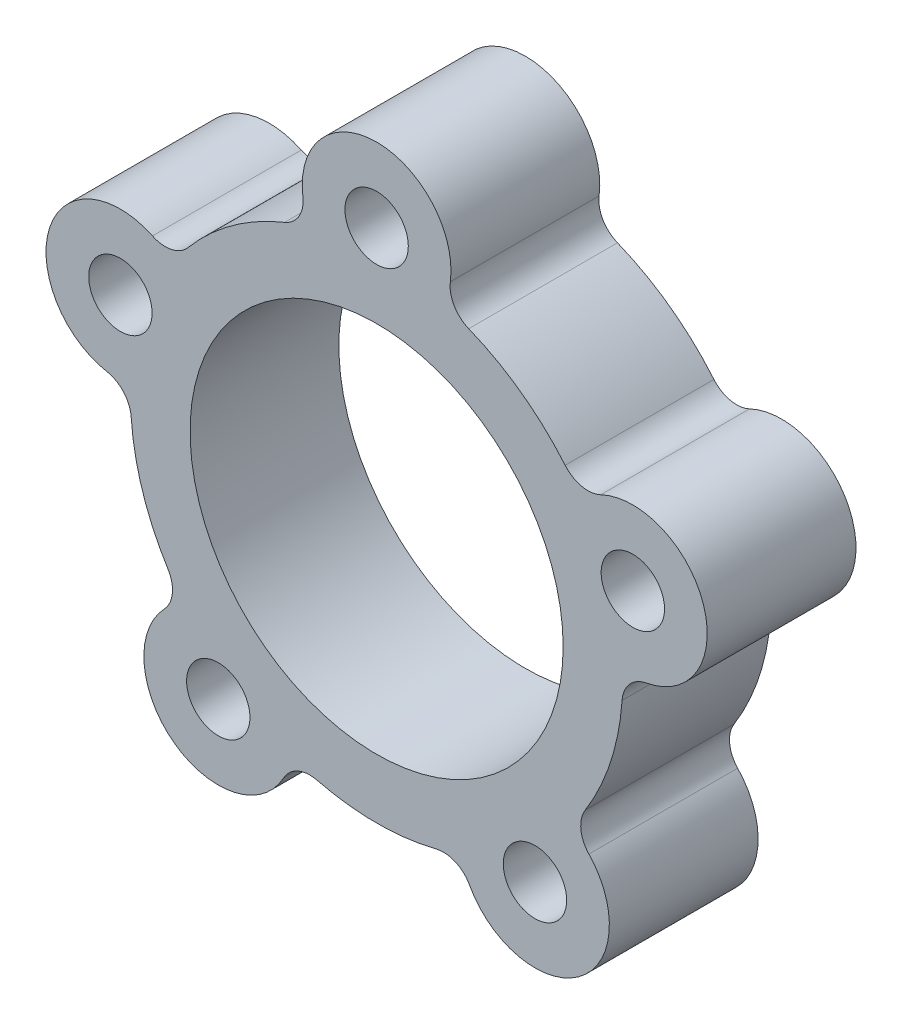
ISO-10303-21;
HEADER;
FILE_DESCRIPTION(('STEP AP214'),'2;1');
FILE_NAME('part.step','',(''),(''),'','','');
FILE_SCHEMA(('AUTOMOTIVE_DESIGN { 1 0 10303 214 1 1 1 1 }'));
ENDSEC;
DATA;
#1=APPLICATION_CONTEXT('core data for automotive mechanical design processes');
#2=APPLICATION_PROTOCOL_DEFINITION('international standard','automotive_design',2000,#1);
#3=PRODUCT_CONTEXT('',#1,'mechanical');
#4=PRODUCT('Part','Part','',(#3));
#5=PRODUCT_RELATED_PRODUCT_CATEGORY('part','',(#4));
#6=PRODUCT_DEFINITION_FORMATION('','',#4);
#7=PRODUCT_DEFINITION_CONTEXT('part definition',#1,'design');
#8=PRODUCT_DEFINITION('design','',#6,#7);
#9=PRODUCT_DEFINITION_SHAPE('','',#8);
#10=(LENGTH_UNIT() NAMED_UNIT(*) SI_UNIT(.MILLI.,.METRE.));
#11=(NAMED_UNIT(*) PLANE_ANGLE_UNIT() SI_UNIT($,.RADIAN.));
#12=(NAMED_UNIT(*) SI_UNIT($,.STERADIAN.) SOLID_ANGLE_UNIT());
#13=UNCERTAINTY_MEASURE_WITH_UNIT(LENGTH_MEASURE(1.E-05),#10,'distance_accuracy_value','');
#14=(GEOMETRIC_REPRESENTATION_CONTEXT(3) GLOBAL_UNCERTAINTY_ASSIGNED_CONTEXT((#13)) GLOBAL_UNIT_ASSIGNED_CONTEXT((#10,
#11,#12)) REPRESENTATION_CONTEXT('',''));
#15=CARTESIAN_POINT('',(0.,0.,0.));
#16=DIRECTION('',(0.,0.,1.));
#17=DIRECTION('',(1.,0.,0.));
#18=AXIS2_PLACEMENT_3D('',#15,#16,#17);
#19=CARTESIAN_POINT('',(2.20330688721595,5.45854672630424,14.224));
#20=DIRECTION('',(0.,0.,1.));
#21=DIRECTION('',(1.,0.,0.));
#22=AXIS2_PLACEMENT_3D('',#19,#20,#21);
#23=PLANE('',#22);
#24=CARTESIAN_POINT('',(-10.9371499373943,3.55369543530763,14.224));
#25=DIRECTION('',(0.,0.,1.));
#26=DIRECTION('',(1.,0.,0.));
#27=AXIS2_PLACEMENT_3D('',#24,#25,#26);
#28=CIRCLE('',#27,1.35255);
#29=CARTESIAN_POINT('',(-9.58459993739428,3.55369543530763,14.224));
#30=VERTEX_POINT('',#29);
#31=EDGE_CURVE('E409',#30,#30,#28,.T.);
#32=ORIENTED_EDGE('',*,*,#31,.F.);
#33=EDGE_LOOP('',(#32));
#34=FACE_BOUND('',#33,.T.);
#35=CARTESIAN_POINT('',(0.,11.4999999999958,14.224));
#36=DIRECTION('',(0.,0.,1.));
#37=DIRECTION('',(1.,0.,0.));
#38=AXIS2_PLACEMENT_3D('',#35,#36,#37);
#39=CIRCLE('',#38,1.35255);
#40=CARTESIAN_POINT('',(1.35255,11.4999999999958,14.224));
#41=VERTEX_POINT('',#40);
#42=EDGE_CURVE('E411',#41,#41,#39,.T.);
#43=ORIENTED_EDGE('',*,*,#42,.F.);
#44=EDGE_LOOP('',(#43));
#45=FACE_BOUND('',#44,.T.);
#46=CARTESIAN_POINT('',(10.9371499373942,3.55369543530779,14.224));
#47=DIRECTION('',(0.,0.,1.));
#48=DIRECTION('',(1.,0.,0.));
#49=AXIS2_PLACEMENT_3D('',#46,#47,#48);
#50=CIRCLE('',#49,1.35255);
#51=CARTESIAN_POINT('',(12.2896999373942,3.55369543530779,14.224));
#52=VERTEX_POINT('',#51);
#53=EDGE_CURVE('E419',#52,#52,#50,.T.);
#54=ORIENTED_EDGE('',*,*,#53,.F.);
#55=EDGE_LOOP('',(#54));
#56=FACE_BOUND('',#55,.T.);
#57=CARTESIAN_POINT('',(6.75953040136352,-9.30369543531607,14.224));
#58=DIRECTION('',(0.,0.,1.));
#59=DIRECTION('',(1.,0.,0.));
#60=AXIS2_PLACEMENT_3D('',#57,#58,#59);
#61=CIRCLE('',#60,1.35255);
#62=CARTESIAN_POINT('',(8.11208040136352,-9.30369543531607,14.224));
#63=VERTEX_POINT('',#62);
#64=EDGE_CURVE('E425',#63,#63,#61,.T.);
#65=ORIENTED_EDGE('',*,*,#64,.F.);
#66=EDGE_LOOP('',(#65));
#67=FACE_BOUND('',#66,.T.);
#68=CARTESIAN_POINT('',(-6.75953040136339,-9.30369543531617,14.224));
#69=DIRECTION('',(0.,0.,1.));
#70=DIRECTION('',(1.,0.,0.));
#71=AXIS2_PLACEMENT_3D('',#68,#69,#70);
#72=CIRCLE('',#71,1.35255);
#73=CARTESIAN_POINT('',(-5.40698040136339,-9.30369543531617,14.224));
#74=VERTEX_POINT('',#73);
#75=EDGE_CURVE('E431',#74,#74,#72,.T.);
#76=ORIENTED_EDGE('',*,*,#75,.F.);
#77=EDGE_LOOP('',(#76));
#78=FACE_BOUND('',#77,.T.);
#79=CARTESIAN_POINT('',(4.40661377443191,10.9170934526085,14.224));
#80=DIRECTION('',(0.,0.,-1.));
#81=DIRECTION('',(1.,0.,0.));
#82=AXIS2_PLACEMENT_3D('',#79,#80,#81);
#83=CIRCLE('',#82,1.27);
#84=CARTESIAN_POINT('',(3.93125090771865,9.73941346850832,14.224));
#85=VERTEX_POINT('',#84);
#86=CARTESIAN_POINT('',(3.14758126745136,11.0836381804334,14.224));
#87=VERTEX_POINT('',#86);
#88=EDGE_CURVE('E253',#85,#87,#83,.T.);
#89=ORIENTED_EDGE('',*,*,#88,.T.);
#90=CARTESIAN_POINT('',(0.,11.4999999999958,14.224));
#91=DIRECTION('',(0.,0.,1.));
#92=DIRECTION('',(1.,0.,0.));
#93=AXIS2_PLACEMENT_3D('',#90,#91,#92);
#94=CIRCLE('',#93,3.175);
#95=CARTESIAN_POINT('',(-3.14758126745136,11.0836381804334,14.224));
#96=VERTEX_POINT('',#95);
#97=EDGE_CURVE('E141',#87,#96,#94,.T.);
#98=ORIENTED_EDGE('',*,*,#97,.T.);
#99=CARTESIAN_POINT('',(-4.40661377443191,10.9170934526085,14.224));
#100=DIRECTION('',(0.,0.,-1.));
#101=DIRECTION('',(1.,0.,0.));
#102=AXIS2_PLACEMENT_3D('',#99,#100,#101);
#103=CIRCLE('',#102,1.27);
#104=CARTESIAN_POINT('',(-3.93125090771865,9.73941346850832,14.224));
#105=VERTEX_POINT('',#104);
#106=EDGE_CURVE('E304',#96,#105,#103,.T.);
#107=ORIENTED_EDGE('',*,*,#106,.T.);
#108=CARTESIAN_POINT('',(0.,0.,14.224));
#109=DIRECTION('',(0.,0.,1.));
#110=DIRECTION('',(1.,0.,0.));
#111=AXIS2_PLACEMENT_3D('',#108,#109,#110);
#112=CIRCLE('',#111,10.5029);
#113=CARTESIAN_POINT('',(-8.04790930448323,6.74848606998727,14.224));
#114=VERTEX_POINT('',#113);
#115=EDGE_CURVE('E323',#105,#114,#112,.T.);
#116=ORIENTED_EDGE('',*,*,#115,.T.);
#117=CARTESIAN_POINT('',(-9.02105432316319,7.56450615100145,14.224));
#118=DIRECTION('',(0.,0.,-1.));
#119=DIRECTION('',(1.,0.,0.));
#120=AXIS2_PLACEMENT_3D('',#117,#118,#119);
#121=CIRCLE('',#120,1.27);
#122=CARTESIAN_POINT('',(-9.5685102129435,6.41856023223179,14.224));
#123=VERTEX_POINT('',#122);
#124=EDGE_CURVE('E320',#114,#123,#121,.T.);
#125=ORIENTED_EDGE('',*,*,#124,.T.);
#126=CARTESIAN_POINT('',(-10.9371499373943,3.55369543530763,14.224));
#127=DIRECTION('',(0.,0.,1.));
#128=DIRECTION('',(1.,0.,0.));
#129=AXIS2_PLACEMENT_3D('',#126,#127,#128);
#130=CIRCLE('',#129,3.175);
#131=CARTESIAN_POINT('',(-11.5138224185786,0.431504882275248,14.224));
#132=VERTEX_POINT('',#131);
#133=EDGE_CURVE('E322',#123,#132,#130,.T.);
#134=ORIENTED_EDGE('',*,*,#133,.T.);
#135=CARTESIAN_POINT('',(-11.7444914110524,-0.817371338937707,14.224));
#136=DIRECTION('',(0.,0.,-1.));
#137=DIRECTION('',(1.,0.,0.));
#138=AXIS2_PLACEMENT_3D('',#135,#136,#137);
#139=CIRCLE('',#138,1.27);
#140=CARTESIAN_POINT('',(-10.4775559837544,-0.729197515967081,14.224));
#141=VERTEX_POINT('',#140);
#142=EDGE_CURVE('E325',#132,#141,#139,.T.);
#143=ORIENTED_EDGE('',*,*,#142,.T.);
#144=CARTESIAN_POINT('',(0.,0.,14.224));
#145=DIRECTION('',(0.,0.,1.));
#146=DIRECTION('',(1.,0.,0.));
#147=AXIS2_PLACEMENT_3D('',#144,#145,#146);
#148=CIRCLE('',#147,10.5029);
#149=CARTESIAN_POINT('',(-8.90513239626248,-5.56861970465182,14.224));
#150=VERTEX_POINT('',#149);
#151=EDGE_CURVE('E331',#141,#150,#148,.T.);
#152=ORIENTED_EDGE('',*,*,#151,.T.);
#153=CARTESIAN_POINT('',(-9.98193196050219,-6.24197154318288,14.224));
#154=DIRECTION('',(0.,0.,-1.));
#155=DIRECTION('',(1.,0.,0.));
#156=AXIS2_PLACEMENT_3D('',#153,#154,#155);
#157=CIRCLE('',#156,1.27);
#158=CARTESIAN_POINT('',(-9.06124580074825,-7.11674979807811,14.224));
#159=VERTEX_POINT('',#158);
#160=EDGE_CURVE('E333',#150,#159,#157,.T.);
#161=ORIENTED_EDGE('',*,*,#160,.T.);
#162=CARTESIAN_POINT('',(-6.75953040136339,-9.30369543531617,14.224));
#163=DIRECTION('',(0.,0.,1.));
#164=DIRECTION('',(1.,0.,0.));
#165=AXIS2_PLACEMENT_3D('',#162,#163,#164);
#166=CIRCLE('',#165,3.175);
#167=CARTESIAN_POINT('',(-3.96835232765976,-10.8169534968761,14.224));
#168=VERTEX_POINT('',#167);
#169=EDGE_CURVE('E335',#159,#168,#166,.T.);
#170=ORIENTED_EDGE('',*,*,#169,.T.);
#171=CARTESIAN_POINT('',(-2.85188109817831,-11.4222567215001,14.224));
#172=DIRECTION('',(0.,0.,-1.));
#173=DIRECTION('',(1.,0.,0.));
#174=AXIS2_PLACEMENT_3D('',#171,#172,#173);
#175=CIRCLE('',#174,1.27);
#176=CARTESIAN_POINT('',(-2.54423480927019,-10.1900823178862,14.224));
#177=VERTEX_POINT('',#176);
#178=EDGE_CURVE('E337',#168,#177,#175,.T.);
#179=ORIENTED_EDGE('',*,*,#178,.T.);
#180=CARTESIAN_POINT('',(0.,0.,14.224));
#181=DIRECTION('',(0.,0.,1.));
#182=DIRECTION('',(1.,0.,0.));
#183=AXIS2_PLACEMENT_3D('',#180,#181,#182);
#184=CIRCLE('',#183,10.5029);
#185=CARTESIAN_POINT('',(2.54423480927033,-10.1900823178862,14.224));
#186=VERTEX_POINT('',#185);
#187=EDGE_CURVE('E339',#177,#186,#184,.T.);
#188=ORIENTED_EDGE('',*,*,#187,.T.);
#189=CARTESIAN_POINT('',(2.85188109817848,-11.4222567215,14.224));
#190=DIRECTION('',(0.,0.,-1.));
#191=DIRECTION('',(1.,0.,0.));
#192=AXIS2_PLACEMENT_3D('',#189,#190,#191);
#193=CIRCLE('',#192,1.27);
#194=CARTESIAN_POINT('',(3.96835232765992,-10.816953496876,14.224));
#195=VERTEX_POINT('',#194);
#196=EDGE_CURVE('E341',#186,#195,#193,.T.);
#197=ORIENTED_EDGE('',*,*,#196,.T.);
#198=CARTESIAN_POINT('',(6.75953040136352,-9.30369543531607,14.224));
#199=DIRECTION('',(0.,0.,1.));
#200=DIRECTION('',(1.,0.,0.));
#201=AXIS2_PLACEMENT_3D('',#198,#199,#200);
#202=CIRCLE('',#201,3.175);
#203=CARTESIAN_POINT('',(9.06124580074835,-7.11674979807798,14.224));
#204=VERTEX_POINT('',#203);
#205=EDGE_CURVE('E343',#195,#204,#202,.T.);
#206=ORIENTED_EDGE('',*,*,#205,.T.);
#207=CARTESIAN_POINT('',(9.98193196050228,-6.24197154318274,14.224));
#208=DIRECTION('',(0.,0.,-1.));
#209=DIRECTION('',(1.,0.,0.));
#210=AXIS2_PLACEMENT_3D('',#207,#208,#209);
#211=CIRCLE('',#210,1.27);
#212=CARTESIAN_POINT('',(8.90513239626255,-5.5686197046517,14.224));
#213=VERTEX_POINT('',#212);
#214=EDGE_CURVE('E345',#204,#213,#211,.T.);
#215=ORIENTED_EDGE('',*,*,#214,.T.);
#216=CARTESIAN_POINT('',(0.,0.,14.224));
#217=DIRECTION('',(0.,0.,1.));
#218=DIRECTION('',(1.,0.,0.));
#219=AXIS2_PLACEMENT_3D('',#216,#217,#218);
#220=CIRCLE('',#219,10.5029);
#221=CARTESIAN_POINT('',(10.4775559837544,-0.729197515966938,14.224));
#222=VERTEX_POINT('',#221);
#223=EDGE_CURVE('E347',#213,#222,#220,.T.);
#224=ORIENTED_EDGE('',*,*,#223,.T.);
#225=CARTESIAN_POINT('',(11.7444914110524,-0.817371338937544,14.224));
#226=DIRECTION('',(0.,0.,-1.));
#227=DIRECTION('',(1.,0.,0.));
#228=AXIS2_PLACEMENT_3D('',#225,#226,#227);
#229=CIRCLE('',#228,1.27);
#230=CARTESIAN_POINT('',(11.5138224185786,0.431504882275408,14.224));
#231=VERTEX_POINT('',#230);
#232=EDGE_CURVE('E196',#222,#231,#229,.T.);
#233=ORIENTED_EDGE('',*,*,#232,.T.);
#234=CARTESIAN_POINT('',(10.9371499373942,3.55369543530779,14.224));
#235=DIRECTION('',(0.,0.,1.));
#236=DIRECTION('',(1.,0.,0.));
#237=AXIS2_PLACEMENT_3D('',#234,#235,#236);
#238=CIRCLE('',#237,3.175);
#239=CARTESIAN_POINT('',(9.5685102129434,6.41856023223192,14.224));
#240=VERTEX_POINT('',#239);
#241=EDGE_CURVE('E190',#231,#240,#238,.T.);
#242=ORIENTED_EDGE('',*,*,#241,.T.);
#243=CARTESIAN_POINT('',(9.02105432316308,7.56450615100158,14.224));
#244=DIRECTION('',(0.,0.,-1.));
#245=DIRECTION('',(1.,0.,0.));
#246=AXIS2_PLACEMENT_3D('',#243,#244,#245);
#247=CIRCLE('',#246,1.27);
#248=CARTESIAN_POINT('',(8.04790930448314,6.74848606998738,14.224));
#249=VERTEX_POINT('',#248);
#250=EDGE_CURVE('E194',#240,#249,#247,.T.);
#251=ORIENTED_EDGE('',*,*,#250,.T.);
#252=CARTESIAN_POINT('',(0.,0.,14.224));
#253=DIRECTION('',(0.,0.,1.));
#254=DIRECTION('',(1.,0.,0.));
#255=AXIS2_PLACEMENT_3D('',#252,#253,#254);
#256=CIRCLE('',#255,10.5029);
#257=EDGE_CURVE('E62',#249,#85,#256,.T.);
#258=ORIENTED_EDGE('',*,*,#257,.T.);
#259=EDGE_LOOP('',(#89,#98,#107,#116,#125,#134,#143,#152,#161,#170,#179,#188,#197,#206,#215,
#224,#233,#242,#251,#258));
#260=FACE_BOUND('',#259,.T.);
#261=CARTESIAN_POINT('',(0.,0.,14.224));
#262=DIRECTION('',(0.,0.,1.));
#263=DIRECTION('',(1.,0.,0.));
#264=AXIS2_PLACEMENT_3D('',#261,#262,#263);
#265=CIRCLE('',#264,7.9629);
#266=CARTESIAN_POINT('',(7.9629,0.,14.224));
#267=VERTEX_POINT('',#266);
#268=EDGE_CURVE('E218',#267,#267,#265,.T.);
#269=ORIENTED_EDGE('',*,*,#268,.F.);
#270=EDGE_LOOP('',(#269));
#271=FACE_BOUND('',#270,.T.);
#272=ADVANCED_FACE('F45',(#34,#45,#56,#67,#78,#260,#271),#23,.T.);
#273=CARTESIAN_POINT('',(2.20330688721595,5.45854672630424,7.874));
#274=DIRECTION('',(0.,0.,1.));
#275=DIRECTION('',(1.,0.,0.));
#276=AXIS2_PLACEMENT_3D('',#273,#274,#275);
#277=PLANE('',#276);
#278=CARTESIAN_POINT('',(-10.9371499373943,3.55369543530763,7.874));
#279=DIRECTION('',(0.,0.,1.));
#280=DIRECTION('',(1.,0.,0.));
#281=AXIS2_PLACEMENT_3D('',#278,#279,#280);
#282=CIRCLE('',#281,1.35255);
#283=CARTESIAN_POINT('',(-9.58459993739428,3.55369543530763,7.874));
#284=VERTEX_POINT('',#283);
#285=EDGE_CURVE('E407',#284,#284,#282,.T.);
#286=ORIENTED_EDGE('',*,*,#285,.T.);
#287=EDGE_LOOP('',(#286));
#288=FACE_BOUND('',#287,.T.);
#289=CARTESIAN_POINT('',(0.,11.4999999999958,7.874));
#290=DIRECTION('',(0.,0.,1.));
#291=DIRECTION('',(1.,0.,0.));
#292=AXIS2_PLACEMENT_3D('',#289,#290,#291);
#293=CIRCLE('',#292,1.35255);
#294=CARTESIAN_POINT('',(1.35255,11.4999999999958,7.874));
#295=VERTEX_POINT('',#294);
#296=EDGE_CURVE('E416',#295,#295,#293,.T.);
#297=ORIENTED_EDGE('',*,*,#296,.T.);
#298=EDGE_LOOP('',(#297));
#299=FACE_BOUND('',#298,.T.);
#300=CARTESIAN_POINT('',(10.9371499373942,3.55369543530779,7.874));
#301=DIRECTION('',(0.,0.,1.));
#302=DIRECTION('',(1.,0.,0.));
#303=AXIS2_PLACEMENT_3D('',#300,#301,#302);
#304=CIRCLE('',#303,1.35255);
#305=CARTESIAN_POINT('',(12.2896999373942,3.55369543530779,7.874));
#306=VERTEX_POINT('',#305);
#307=EDGE_CURVE('E422',#306,#306,#304,.T.);
#308=ORIENTED_EDGE('',*,*,#307,.T.);
#309=EDGE_LOOP('',(#308));
#310=FACE_BOUND('',#309,.T.);
#311=CARTESIAN_POINT('',(6.75953040136352,-9.30369543531607,7.874));
#312=DIRECTION('',(0.,0.,1.));
#313=DIRECTION('',(1.,0.,0.));
#314=AXIS2_PLACEMENT_3D('',#311,#312,#313);
#315=CIRCLE('',#314,1.35255);
#316=CARTESIAN_POINT('',(8.11208040136352,-9.30369543531607,7.874));
#317=VERTEX_POINT('',#316);
#318=EDGE_CURVE('E428',#317,#317,#315,.T.);
#319=ORIENTED_EDGE('',*,*,#318,.T.);
#320=EDGE_LOOP('',(#319));
#321=FACE_BOUND('',#320,.T.);
#322=CARTESIAN_POINT('',(-6.75953040136339,-9.30369543531617,7.874));
#323=DIRECTION('',(0.,0.,1.));
#324=DIRECTION('',(1.,0.,0.));
#325=AXIS2_PLACEMENT_3D('',#322,#323,#324);
#326=CIRCLE('',#325,1.35255);
#327=CARTESIAN_POINT('',(-5.40698040136339,-9.30369543531617,7.874));
#328=VERTEX_POINT('',#327);
#329=EDGE_CURVE('E434',#328,#328,#326,.T.);
#330=ORIENTED_EDGE('',*,*,#329,.T.);
#331=EDGE_LOOP('',(#330));
#332=FACE_BOUND('',#331,.T.);
#333=CARTESIAN_POINT('',(4.40661377443191,10.9170934526085,7.874));
#334=DIRECTION('',(0.,0.,-1.));
#335=DIRECTION('',(1.,0.,0.));
#336=AXIS2_PLACEMENT_3D('',#333,#334,#335);
#337=CIRCLE('',#336,1.27);
#338=CARTESIAN_POINT('',(3.93125090771865,9.73941346850832,7.874));
#339=VERTEX_POINT('',#338);
#340=CARTESIAN_POINT('',(3.14758126745136,11.0836381804334,7.874));
#341=VERTEX_POINT('',#340);
#342=EDGE_CURVE('E214',#339,#341,#337,.T.);
#343=ORIENTED_EDGE('',*,*,#342,.F.);
#344=CARTESIAN_POINT('',(0.,0.,7.874));
#345=DIRECTION('',(0.,0.,1.));
#346=DIRECTION('',(1.,0.,0.));
#347=AXIS2_PLACEMENT_3D('',#344,#345,#346);
#348=CIRCLE('',#347,10.5029);
#349=CARTESIAN_POINT('',(8.04790930448314,6.74848606998738,7.874));
#350=VERTEX_POINT('',#349);
#351=EDGE_CURVE('E133',#350,#339,#348,.T.);
#352=ORIENTED_EDGE('',*,*,#351,.F.);
#353=CARTESIAN_POINT('',(9.02105432316308,7.56450615100158,7.874));
#354=DIRECTION('',(0.,0.,-1.));
#355=DIRECTION('',(1.,0.,0.));
#356=AXIS2_PLACEMENT_3D('',#353,#354,#355);
#357=CIRCLE('',#356,1.27);
#358=CARTESIAN_POINT('',(9.5685102129434,6.41856023223192,7.874));
#359=VERTEX_POINT('',#358);
#360=EDGE_CURVE('E127',#359,#350,#357,.T.);
#361=ORIENTED_EDGE('',*,*,#360,.F.);
#362=CARTESIAN_POINT('',(10.9371499373942,3.55369543530779,7.874));
#363=DIRECTION('',(0.,0.,1.));
#364=DIRECTION('',(1.,0.,0.));
#365=AXIS2_PLACEMENT_3D('',#362,#363,#364);
#366=CIRCLE('',#365,3.175);
#367=CARTESIAN_POINT('',(11.5138224185786,0.431504882275408,7.874));
#368=VERTEX_POINT('',#367);
#369=EDGE_CURVE('E204',#368,#359,#366,.T.);
#370=ORIENTED_EDGE('',*,*,#369,.F.);
#371=CARTESIAN_POINT('',(11.7444914110524,-0.817371338937544,7.874));
#372=DIRECTION('',(0.,0.,-1.));
#373=DIRECTION('',(1.,0.,0.));
#374=AXIS2_PLACEMENT_3D('',#371,#372,#373);
#375=CIRCLE('',#374,1.27);
#376=CARTESIAN_POINT('',(10.4775559837544,-0.729197515966938,7.874));
#377=VERTEX_POINT('',#376);
#378=EDGE_CURVE('E248',#377,#368,#375,.T.);
#379=ORIENTED_EDGE('',*,*,#378,.F.);
#380=CARTESIAN_POINT('',(0.,0.,7.874));
#381=DIRECTION('',(0.,0.,1.));
#382=DIRECTION('',(1.,0.,0.));
#383=AXIS2_PLACEMENT_3D('',#380,#381,#382);
#384=CIRCLE('',#383,10.5029);
#385=CARTESIAN_POINT('',(8.90513239626255,-5.5686197046517,7.874));
#386=VERTEX_POINT('',#385);
#387=EDGE_CURVE('E246',#386,#377,#384,.T.);
#388=ORIENTED_EDGE('',*,*,#387,.F.);
#389=CARTESIAN_POINT('',(9.98193196050228,-6.24197154318274,7.874));
#390=DIRECTION('',(0.,0.,-1.));
#391=DIRECTION('',(1.,0.,0.));
#392=AXIS2_PLACEMENT_3D('',#389,#390,#391);
#393=CIRCLE('',#392,1.27);
#394=CARTESIAN_POINT('',(9.06124580074835,-7.11674979807798,7.874));
#395=VERTEX_POINT('',#394);
#396=EDGE_CURVE('E244',#395,#386,#393,.T.);
#397=ORIENTED_EDGE('',*,*,#396,.F.);
#398=CARTESIAN_POINT('',(6.75953040136352,-9.30369543531607,7.874));
#399=DIRECTION('',(0.,0.,1.));
#400=DIRECTION('',(1.,0.,0.));
#401=AXIS2_PLACEMENT_3D('',#398,#399,#400);
#402=CIRCLE('',#401,3.175);
#403=CARTESIAN_POINT('',(3.96835232765992,-10.816953496876,7.874));
#404=VERTEX_POINT('',#403);
#405=EDGE_CURVE('E242',#404,#395,#402,.T.);
#406=ORIENTED_EDGE('',*,*,#405,.F.);
#407=CARTESIAN_POINT('',(2.85188109817848,-11.4222567215,7.874));
#408=DIRECTION('',(0.,0.,-1.));
#409=DIRECTION('',(1.,0.,0.));
#410=AXIS2_PLACEMENT_3D('',#407,#408,#409);
#411=CIRCLE('',#410,1.27);
#412=CARTESIAN_POINT('',(2.54423480927033,-10.1900823178862,7.874));
#413=VERTEX_POINT('',#412);
#414=EDGE_CURVE('E240',#413,#404,#411,.T.);
#415=ORIENTED_EDGE('',*,*,#414,.F.);
#416=CARTESIAN_POINT('',(0.,0.,7.874));
#417=DIRECTION('',(0.,0.,1.));
#418=DIRECTION('',(1.,0.,0.));
#419=AXIS2_PLACEMENT_3D('',#416,#417,#418);
#420=CIRCLE('',#419,10.5029);
#421=CARTESIAN_POINT('',(-2.54423480927019,-10.1900823178862,7.874));
#422=VERTEX_POINT('',#421);
#423=EDGE_CURVE('E238',#422,#413,#420,.T.);
#424=ORIENTED_EDGE('',*,*,#423,.F.);
#425=CARTESIAN_POINT('',(-2.85188109817831,-11.4222567215001,7.874));
#426=DIRECTION('',(0.,0.,-1.));
#427=DIRECTION('',(1.,0.,0.));
#428=AXIS2_PLACEMENT_3D('',#425,#426,#427);
#429=CIRCLE('',#428,1.27);
#430=CARTESIAN_POINT('',(-3.96835232765976,-10.8169534968761,7.874));
#431=VERTEX_POINT('',#430);
#432=EDGE_CURVE('E236',#431,#422,#429,.T.);
#433=ORIENTED_EDGE('',*,*,#432,.F.);
#434=CARTESIAN_POINT('',(-6.75953040136339,-9.30369543531617,7.874));
#435=DIRECTION('',(0.,0.,1.));
#436=DIRECTION('',(1.,0.,0.));
#437=AXIS2_PLACEMENT_3D('',#434,#435,#436);
#438=CIRCLE('',#437,3.175);
#439=CARTESIAN_POINT('',(-9.06124580074825,-7.11674979807811,7.874));
#440=VERTEX_POINT('',#439);
#441=EDGE_CURVE('E234',#440,#431,#438,.T.);
#442=ORIENTED_EDGE('',*,*,#441,.F.);
#443=CARTESIAN_POINT('',(-9.98193196050219,-6.24197154318288,7.874));
#444=DIRECTION('',(0.,0.,-1.));
#445=DIRECTION('',(1.,0.,0.));
#446=AXIS2_PLACEMENT_3D('',#443,#444,#445);
#447=CIRCLE('',#446,1.27);
#448=CARTESIAN_POINT('',(-8.90513239626248,-5.56861970465182,7.874));
#449=VERTEX_POINT('',#448);
#450=EDGE_CURVE('E232',#449,#440,#447,.T.);
#451=ORIENTED_EDGE('',*,*,#450,.F.);
#452=CARTESIAN_POINT('',(0.,0.,7.874));
#453=DIRECTION('',(0.,0.,1.));
#454=DIRECTION('',(1.,0.,0.));
#455=AXIS2_PLACEMENT_3D('',#452,#453,#454);
#456=CIRCLE('',#455,10.5029);
#457=CARTESIAN_POINT('',(-10.4775559837544,-0.729197515967081,7.874));
#458=VERTEX_POINT('',#457);
#459=EDGE_CURVE('E230',#458,#449,#456,.T.);
#460=ORIENTED_EDGE('',*,*,#459,.F.);
#461=CARTESIAN_POINT('',(-11.7444914110524,-0.817371338937707,7.874));
#462=DIRECTION('',(0.,0.,-1.));
#463=DIRECTION('',(1.,0.,0.));
#464=AXIS2_PLACEMENT_3D('',#461,#462,#463);
#465=CIRCLE('',#464,1.27);
#466=CARTESIAN_POINT('',(-11.5138224185786,0.431504882275248,7.874));
#467=VERTEX_POINT('',#466);
#468=EDGE_CURVE('E228',#467,#458,#465,.T.);
#469=ORIENTED_EDGE('',*,*,#468,.F.);
#470=CARTESIAN_POINT('',(-10.9371499373943,3.55369543530763,7.874));
#471=DIRECTION('',(0.,0.,1.));
#472=DIRECTION('',(1.,0.,0.));
#473=AXIS2_PLACEMENT_3D('',#470,#471,#472);
#474=CIRCLE('',#473,3.175);
#475=CARTESIAN_POINT('',(-9.5685102129435,6.41856023223179,7.874));
#476=VERTEX_POINT('',#475);
#477=EDGE_CURVE('E226',#476,#467,#474,.T.);
#478=ORIENTED_EDGE('',*,*,#477,.F.);
#479=CARTESIAN_POINT('',(-9.02105432316319,7.56450615100145,7.874));
#480=DIRECTION('',(0.,0.,-1.));
#481=DIRECTION('',(1.,0.,0.));
#482=AXIS2_PLACEMENT_3D('',#479,#480,#481);
#483=CIRCLE('',#482,1.27);
#484=CARTESIAN_POINT('',(-8.04790930448323,6.74848606998727,7.874));
#485=VERTEX_POINT('',#484);
#486=EDGE_CURVE('E224',#485,#476,#483,.T.);
#487=ORIENTED_EDGE('',*,*,#486,.F.);
#488=CARTESIAN_POINT('',(0.,0.,7.874));
#489=DIRECTION('',(0.,0.,1.));
#490=DIRECTION('',(1.,0.,0.));
#491=AXIS2_PLACEMENT_3D('',#488,#489,#490);
#492=CIRCLE('',#491,10.5029);
#493=CARTESIAN_POINT('',(-3.93125090771865,9.73941346850832,7.874));
#494=VERTEX_POINT('',#493);
#495=EDGE_CURVE('E222',#494,#485,#492,.T.);
#496=ORIENTED_EDGE('',*,*,#495,.F.);
#497=CARTESIAN_POINT('',(-4.40661377443191,10.9170934526085,7.874));
#498=DIRECTION('',(0.,0.,-1.));
#499=DIRECTION('',(1.,0.,0.));
#500=AXIS2_PLACEMENT_3D('',#497,#498,#499);
#501=CIRCLE('',#500,1.27);
#502=CARTESIAN_POINT('',(-3.14758126745136,11.0836381804334,7.874));
#503=VERTEX_POINT('',#502);
#504=EDGE_CURVE('E220',#503,#494,#501,.T.);
#505=ORIENTED_EDGE('',*,*,#504,.F.);
#506=CARTESIAN_POINT('',(0.,11.4999999999958,7.874));
#507=DIRECTION('',(0.,0.,1.));
#508=DIRECTION('',(1.,0.,0.));
#509=AXIS2_PLACEMENT_3D('',#506,#507,#508);
#510=CIRCLE('',#509,3.175);
#511=EDGE_CURVE('E217',#341,#503,#510,.T.);
#512=ORIENTED_EDGE('',*,*,#511,.F.);
#513=EDGE_LOOP('',(#343,#352,#361,#370,#379,#388,#397,#406,#415,#424,#433,#442,#451,#460,#469,
#478,#487,#496,#505,#512));
#514=FACE_BOUND('',#513,.T.);
#515=CARTESIAN_POINT('',(0.,0.,7.874));
#516=DIRECTION('',(0.,0.,1.));
#517=DIRECTION('',(1.,0.,0.));
#518=AXIS2_PLACEMENT_3D('',#515,#516,#517);
#519=CIRCLE('',#518,7.9629);
#520=CARTESIAN_POINT('',(7.9629,0.,7.874));
#521=VERTEX_POINT('',#520);
#522=EDGE_CURVE('E437',#521,#521,#519,.T.);
#523=ORIENTED_EDGE('',*,*,#522,.T.);
#524=EDGE_LOOP('',(#523));
#525=FACE_BOUND('',#524,.T.);
#526=ADVANCED_FACE('F308',(#288,#299,#310,#321,#332,#514,#525),#277,.F.);
#527=CARTESIAN_POINT('',(4.40661377443191,10.9170934526085,14.224));
#528=DIRECTION('',(0.,0.,-1.));
#529=DIRECTION('',(-1.,0.,0.));
#530=AXIS2_PLACEMENT_3D('',#527,#528,#529);
#531=CYLINDRICAL_SURFACE('',#530,1.27);
#532=ORIENTED_EDGE('',*,*,#342,.T.);
#533=DIRECTION('',(0.,0.,-1.));
#534=VECTOR('',#533,1.);
#535=CARTESIAN_POINT('',(3.14758126745136,11.0836381804334,14.224));
#536=LINE('',#535,#534);
#537=EDGE_CURVE('E11',#87,#341,#536,.T.);
#538=ORIENTED_EDGE('',*,*,#537,.F.);
#539=ORIENTED_EDGE('',*,*,#88,.F.);
#540=DIRECTION('',(0.,0.,-1.));
#541=VECTOR('',#540,1.);
#542=CARTESIAN_POINT('',(3.93125090771865,9.73941346850832,14.224));
#543=LINE('',#542,#541);
#544=EDGE_CURVE('E210',#85,#339,#543,.T.);
#545=ORIENTED_EDGE('',*,*,#544,.T.);
#546=EDGE_LOOP('',(#532,#538,#539,#545));
#547=FACE_BOUND('',#546,.T.);
#548=ADVANCED_FACE('F47',(#547),#531,.F.);
#549=CARTESIAN_POINT('',(0.,11.4999999999958,14.224));
#550=DIRECTION('',(0.,0.,-1.));
#551=DIRECTION('',(-1.,0.,0.));
#552=AXIS2_PLACEMENT_3D('',#549,#550,#551);
#553=CYLINDRICAL_SURFACE('',#552,3.175);
#554=ORIENTED_EDGE('',*,*,#511,.T.);
#555=DIRECTION('',(0.,0.,-1.));
#556=VECTOR('',#555,1.);
#557=CARTESIAN_POINT('',(-3.14758126745136,11.0836381804334,14.224));
#558=LINE('',#557,#556);
#559=EDGE_CURVE('E54',#96,#503,#558,.T.);
#560=ORIENTED_EDGE('',*,*,#559,.F.);
#561=ORIENTED_EDGE('',*,*,#97,.F.);
#562=ORIENTED_EDGE('',*,*,#537,.T.);
#563=EDGE_LOOP('',(#554,#560,#561,#562));
#564=FACE_BOUND('',#563,.T.);
#565=ADVANCED_FACE('F518',(#564),#553,.T.);
#566=CARTESIAN_POINT('',(-4.40661377443191,10.9170934526085,14.224));
#567=DIRECTION('',(0.,0.,-1.));
#568=DIRECTION('',(-1.,0.,0.));
#569=AXIS2_PLACEMENT_3D('',#566,#567,#568);
#570=CYLINDRICAL_SURFACE('',#569,1.27);
#571=ORIENTED_EDGE('',*,*,#504,.T.);
#572=DIRECTION('',(0.,0.,-1.));
#573=VECTOR('',#572,1.);
#574=CARTESIAN_POINT('',(-3.93125090771865,9.73941346850832,14.224));
#575=LINE('',#574,#573);
#576=EDGE_CURVE('E296',#105,#494,#575,.T.);
#577=ORIENTED_EDGE('',*,*,#576,.F.);
#578=ORIENTED_EDGE('',*,*,#106,.F.);
#579=ORIENTED_EDGE('',*,*,#559,.T.);
#580=EDGE_LOOP('',(#571,#577,#578,#579));
#581=FACE_BOUND('',#580,.T.);
#582=ADVANCED_FACE('F302',(#581),#570,.F.);
#583=CARTESIAN_POINT('',(0.,0.,14.224));
#584=DIRECTION('',(0.,0.,-1.));
#585=DIRECTION('',(-1.,0.,0.));
#586=AXIS2_PLACEMENT_3D('',#583,#584,#585);
#587=CYLINDRICAL_SURFACE('',#586,10.5029);
#588=ORIENTED_EDGE('',*,*,#495,.T.);
#589=DIRECTION('',(0.,0.,-1.));
#590=VECTOR('',#589,1.);
#591=CARTESIAN_POINT('',(-8.04790930448323,6.74848606998727,14.224));
#592=LINE('',#591,#590);
#593=EDGE_CURVE('E293',#114,#485,#592,.T.);
#594=ORIENTED_EDGE('',*,*,#593,.F.);
#595=ORIENTED_EDGE('',*,*,#115,.F.);
#596=ORIENTED_EDGE('',*,*,#576,.T.);
#597=EDGE_LOOP('',(#588,#594,#595,#596));
#598=FACE_BOUND('',#597,.T.);
#599=ADVANCED_FACE('F314',(#598),#587,.T.);
#600=CARTESIAN_POINT('',(-9.02105432316319,7.56450615100145,14.224));
#601=DIRECTION('',(0.,0.,-1.));
#602=DIRECTION('',(-1.,0.,0.));
#603=AXIS2_PLACEMENT_3D('',#600,#601,#602);
#604=CYLINDRICAL_SURFACE('',#603,1.27);
#605=ORIENTED_EDGE('',*,*,#486,.T.);
#606=DIRECTION('',(0.,0.,-1.));
#607=VECTOR('',#606,1.);
#608=CARTESIAN_POINT('',(-9.5685102129435,6.41856023223179,14.224));
#609=LINE('',#608,#607);
#610=EDGE_CURVE('E290',#123,#476,#609,.T.);
#611=ORIENTED_EDGE('',*,*,#610,.F.);
#612=ORIENTED_EDGE('',*,*,#124,.F.);
#613=ORIENTED_EDGE('',*,*,#593,.T.);
#614=EDGE_LOOP('',(#605,#611,#612,#613));
#615=FACE_BOUND('',#614,.T.);
#616=ADVANCED_FACE('F318',(#615),#604,.F.);
#617=CARTESIAN_POINT('',(-10.9371499373943,3.55369543530763,14.224));
#618=DIRECTION('',(0.,0.,-1.));
#619=DIRECTION('',(-1.,0.,0.));
#620=AXIS2_PLACEMENT_3D('',#617,#618,#619);
#621=CYLINDRICAL_SURFACE('',#620,3.175);
#622=ORIENTED_EDGE('',*,*,#477,.T.);
#623=DIRECTION('',(0.,0.,-1.));
#624=VECTOR('',#623,1.);
#625=CARTESIAN_POINT('',(-11.5138224185786,0.431504882275248,14.224));
#626=LINE('',#625,#624);
#627=EDGE_CURVE('E287',#132,#467,#626,.T.);
#628=ORIENTED_EDGE('',*,*,#627,.F.);
#629=ORIENTED_EDGE('',*,*,#133,.F.);
#630=ORIENTED_EDGE('',*,*,#610,.T.);
#631=EDGE_LOOP('',(#622,#628,#629,#630));
#632=FACE_BOUND('',#631,.T.);
#633=ADVANCED_FACE('F549',(#632),#621,.T.);
#634=CARTESIAN_POINT('',(-11.7444914110524,-0.817371338937707,14.224));
#635=DIRECTION('',(0.,0.,-1.));
#636=DIRECTION('',(-1.,0.,0.));
#637=AXIS2_PLACEMENT_3D('',#634,#635,#636);
#638=CYLINDRICAL_SURFACE('',#637,1.27);
#639=ORIENTED_EDGE('',*,*,#468,.T.);
#640=DIRECTION('',(0.,0.,-1.));
#641=VECTOR('',#640,1.);
#642=CARTESIAN_POINT('',(-10.4775559837544,-0.729197515967081,14.224));
#643=LINE('',#642,#641);
#644=EDGE_CURVE('E284',#141,#458,#643,.T.);
#645=ORIENTED_EDGE('',*,*,#644,.F.);
#646=ORIENTED_EDGE('',*,*,#142,.F.);
#647=ORIENTED_EDGE('',*,*,#627,.T.);
#648=EDGE_LOOP('',(#639,#645,#646,#647));
#649=FACE_BOUND('',#648,.T.);
#650=ADVANCED_FACE('F558',(#649),#638,.F.);
#651=CARTESIAN_POINT('',(0.,0.,14.224));
#652=DIRECTION('',(0.,0.,-1.));
#653=DIRECTION('',(-1.,0.,0.));
#654=AXIS2_PLACEMENT_3D('',#651,#652,#653);
#655=CYLINDRICAL_SURFACE('',#654,10.5029);
#656=ORIENTED_EDGE('',*,*,#459,.T.);
#657=DIRECTION('',(0.,0.,-1.));
#658=VECTOR('',#657,1.);
#659=CARTESIAN_POINT('',(-8.90513239626248,-5.56861970465182,14.224));
#660=LINE('',#659,#658);
#661=EDGE_CURVE('E281',#150,#449,#660,.T.);
#662=ORIENTED_EDGE('',*,*,#661,.F.);
#663=ORIENTED_EDGE('',*,*,#151,.F.);
#664=ORIENTED_EDGE('',*,*,#644,.T.);
#665=EDGE_LOOP('',(#656,#662,#663,#664));
#666=FACE_BOUND('',#665,.T.);
#667=ADVANCED_FACE('F568',(#666),#655,.T.);
#668=CARTESIAN_POINT('',(-9.98193196050219,-6.24197154318288,14.224));
#669=DIRECTION('',(0.,0.,-1.));
#670=DIRECTION('',(-1.,0.,0.));
#671=AXIS2_PLACEMENT_3D('',#668,#669,#670);
#672=CYLINDRICAL_SURFACE('',#671,1.27);
#673=ORIENTED_EDGE('',*,*,#450,.T.);
#674=DIRECTION('',(0.,0.,-1.));
#675=VECTOR('',#674,1.);
#676=CARTESIAN_POINT('',(-9.06124580074825,-7.11674979807811,14.224));
#677=LINE('',#676,#675);
#678=EDGE_CURVE('E278',#159,#440,#677,.T.);
#679=ORIENTED_EDGE('',*,*,#678,.F.);
#680=ORIENTED_EDGE('',*,*,#160,.F.);
#681=ORIENTED_EDGE('',*,*,#661,.T.);
#682=EDGE_LOOP('',(#673,#679,#680,#681));
#683=FACE_BOUND('',#682,.T.);
#684=ADVANCED_FACE('F578',(#683),#672,.F.);
#685=CARTESIAN_POINT('',(-6.75953040136339,-9.30369543531617,14.224));
#686=DIRECTION('',(0.,0.,-1.));
#687=DIRECTION('',(-1.,0.,0.));
#688=AXIS2_PLACEMENT_3D('',#685,#686,#687);
#689=CYLINDRICAL_SURFACE('',#688,3.175);
#690=ORIENTED_EDGE('',*,*,#441,.T.);
#691=DIRECTION('',(0.,0.,-1.));
#692=VECTOR('',#691,1.);
#693=CARTESIAN_POINT('',(-3.96835232765976,-10.8169534968761,14.224));
#694=LINE('',#693,#692);
#695=EDGE_CURVE('E275',#168,#431,#694,.T.);
#696=ORIENTED_EDGE('',*,*,#695,.F.);
#697=ORIENTED_EDGE('',*,*,#169,.F.);
#698=ORIENTED_EDGE('',*,*,#678,.T.);
#699=EDGE_LOOP('',(#690,#696,#697,#698));
#700=FACE_BOUND('',#699,.T.);
#701=ADVANCED_FACE('F588',(#700),#689,.T.);
#702=CARTESIAN_POINT('',(-2.85188109817831,-11.4222567215001,14.224));
#703=DIRECTION('',(0.,0.,-1.));
#704=DIRECTION('',(-1.,0.,0.));
#705=AXIS2_PLACEMENT_3D('',#702,#703,#704);
#706=CYLINDRICAL_SURFACE('',#705,1.27);
#707=ORIENTED_EDGE('',*,*,#432,.T.);
#708=DIRECTION('',(0.,0.,-1.));
#709=VECTOR('',#708,1.);
#710=CARTESIAN_POINT('',(-2.54423480927019,-10.1900823178862,14.224));
#711=LINE('',#710,#709);
#712=EDGE_CURVE('E272',#177,#422,#711,.T.);
#713=ORIENTED_EDGE('',*,*,#712,.F.);
#714=ORIENTED_EDGE('',*,*,#178,.F.);
#715=ORIENTED_EDGE('',*,*,#695,.T.);
#716=EDGE_LOOP('',(#707,#713,#714,#715));
#717=FACE_BOUND('',#716,.T.);
#718=ADVANCED_FACE('F598',(#717),#706,.F.);
#719=CARTESIAN_POINT('',(0.,0.,14.224));
#720=DIRECTION('',(0.,0.,-1.));
#721=DIRECTION('',(-1.,0.,0.));
#722=AXIS2_PLACEMENT_3D('',#719,#720,#721);
#723=CYLINDRICAL_SURFACE('',#722,10.5029);
#724=ORIENTED_EDGE('',*,*,#423,.T.);
#725=DIRECTION('',(0.,0.,-1.));
#726=VECTOR('',#725,1.);
#727=CARTESIAN_POINT('',(2.54423480927033,-10.1900823178862,14.224));
#728=LINE('',#727,#726);
#729=EDGE_CURVE('E269',#186,#413,#728,.T.);
#730=ORIENTED_EDGE('',*,*,#729,.F.);
#731=ORIENTED_EDGE('',*,*,#187,.F.);
#732=ORIENTED_EDGE('',*,*,#712,.T.);
#733=EDGE_LOOP('',(#724,#730,#731,#732));
#734=FACE_BOUND('',#733,.T.);
#735=ADVANCED_FACE('F608',(#734),#723,.T.);
#736=CARTESIAN_POINT('',(2.85188109817848,-11.4222567215,14.224));
#737=DIRECTION('',(0.,0.,-1.));
#738=DIRECTION('',(-1.,0.,0.));
#739=AXIS2_PLACEMENT_3D('',#736,#737,#738);
#740=CYLINDRICAL_SURFACE('',#739,1.27);
#741=ORIENTED_EDGE('',*,*,#414,.T.);
#742=DIRECTION('',(0.,0.,-1.));
#743=VECTOR('',#742,1.);
#744=CARTESIAN_POINT('',(3.96835232765992,-10.816953496876,14.224));
#745=LINE('',#744,#743);
#746=EDGE_CURVE('E266',#195,#404,#745,.T.);
#747=ORIENTED_EDGE('',*,*,#746,.F.);
#748=ORIENTED_EDGE('',*,*,#196,.F.);
#749=ORIENTED_EDGE('',*,*,#729,.T.);
#750=EDGE_LOOP('',(#741,#747,#748,#749));
#751=FACE_BOUND('',#750,.T.);
#752=ADVANCED_FACE('F618',(#751),#740,.F.);
#753=CARTESIAN_POINT('',(6.75953040136352,-9.30369543531607,14.224));
#754=DIRECTION('',(0.,0.,-1.));
#755=DIRECTION('',(-1.,0.,0.));
#756=AXIS2_PLACEMENT_3D('',#753,#754,#755);
#757=CYLINDRICAL_SURFACE('',#756,3.175);
#758=ORIENTED_EDGE('',*,*,#405,.T.);
#759=DIRECTION('',(0.,0.,-1.));
#760=VECTOR('',#759,1.);
#761=CARTESIAN_POINT('',(9.06124580074835,-7.11674979807798,14.224));
#762=LINE('',#761,#760);
#763=EDGE_CURVE('E263',#204,#395,#762,.T.);
#764=ORIENTED_EDGE('',*,*,#763,.F.);
#765=ORIENTED_EDGE('',*,*,#205,.F.);
#766=ORIENTED_EDGE('',*,*,#746,.T.);
#767=EDGE_LOOP('',(#758,#764,#765,#766));
#768=FACE_BOUND('',#767,.T.);
#769=ADVANCED_FACE('F628',(#768),#757,.T.);
#770=CARTESIAN_POINT('',(9.98193196050228,-6.24197154318274,14.224));
#771=DIRECTION('',(0.,0.,-1.));
#772=DIRECTION('',(-1.,0.,0.));
#773=AXIS2_PLACEMENT_3D('',#770,#771,#772);
#774=CYLINDRICAL_SURFACE('',#773,1.27);
#775=ORIENTED_EDGE('',*,*,#396,.T.);
#776=DIRECTION('',(0.,0.,-1.));
#777=VECTOR('',#776,1.);
#778=CARTESIAN_POINT('',(8.90513239626255,-5.5686197046517,14.224));
#779=LINE('',#778,#777);
#780=EDGE_CURVE('E260',#213,#386,#779,.T.);
#781=ORIENTED_EDGE('',*,*,#780,.F.);
#782=ORIENTED_EDGE('',*,*,#214,.F.);
#783=ORIENTED_EDGE('',*,*,#763,.T.);
#784=EDGE_LOOP('',(#775,#781,#782,#783));
#785=FACE_BOUND('',#784,.T.);
#786=ADVANCED_FACE('F638',(#785),#774,.F.);
#787=CARTESIAN_POINT('',(0.,0.,14.224));
#788=DIRECTION('',(0.,0.,-1.));
#789=DIRECTION('',(-1.,0.,0.));
#790=AXIS2_PLACEMENT_3D('',#787,#788,#789);
#791=CYLINDRICAL_SURFACE('',#790,10.5029);
#792=ORIENTED_EDGE('',*,*,#387,.T.);
#793=DIRECTION('',(0.,0.,-1.));
#794=VECTOR('',#793,1.);
#795=CARTESIAN_POINT('',(10.4775559837544,-0.729197515966938,14.224));
#796=LINE('',#795,#794);
#797=EDGE_CURVE('E257',#222,#377,#796,.T.);
#798=ORIENTED_EDGE('',*,*,#797,.F.);
#799=ORIENTED_EDGE('',*,*,#223,.F.);
#800=ORIENTED_EDGE('',*,*,#780,.T.);
#801=EDGE_LOOP('',(#792,#798,#799,#800));
#802=FACE_BOUND('',#801,.T.);
#803=ADVANCED_FACE('F353',(#802),#791,.T.);
#804=CARTESIAN_POINT('',(11.7444914110524,-0.817371338937544,14.224));
#805=DIRECTION('',(0.,0.,-1.));
#806=DIRECTION('',(-1.,0.,0.));
#807=AXIS2_PLACEMENT_3D('',#804,#805,#806);
#808=CYLINDRICAL_SURFACE('',#807,1.27);
#809=ORIENTED_EDGE('',*,*,#378,.T.);
#810=DIRECTION('',(0.,0.,-1.));
#811=VECTOR('',#810,1.);
#812=CARTESIAN_POINT('',(11.5138224185786,0.431504882275408,14.224));
#813=LINE('',#812,#811);
#814=EDGE_CURVE('E205',#231,#368,#813,.T.);
#815=ORIENTED_EDGE('',*,*,#814,.F.);
#816=ORIENTED_EDGE('',*,*,#232,.F.);
#817=ORIENTED_EDGE('',*,*,#797,.T.);
#818=EDGE_LOOP('',(#809,#815,#816,#817));
#819=FACE_BOUND('',#818,.T.);
#820=ADVANCED_FACE('F357',(#819),#808,.F.);
#821=CARTESIAN_POINT('',(10.9371499373942,3.55369543530779,14.224));
#822=DIRECTION('',(0.,0.,-1.));
#823=DIRECTION('',(-1.,0.,0.));
#824=AXIS2_PLACEMENT_3D('',#821,#822,#823);
#825=CYLINDRICAL_SURFACE('',#824,3.175);
#826=ORIENTED_EDGE('',*,*,#369,.T.);
#827=DIRECTION('',(0.,0.,-1.));
#828=VECTOR('',#827,1.);
#829=CARTESIAN_POINT('',(9.5685102129434,6.41856023223192,14.224));
#830=LINE('',#829,#828);
#831=EDGE_CURVE('E201',#240,#359,#830,.T.);
#832=ORIENTED_EDGE('',*,*,#831,.F.);
#833=ORIENTED_EDGE('',*,*,#241,.F.);
#834=ORIENTED_EDGE('',*,*,#814,.T.);
#835=EDGE_LOOP('',(#826,#832,#833,#834));
#836=FACE_BOUND('',#835,.T.);
#837=ADVANCED_FACE('F202',(#836),#825,.T.);
#838=CARTESIAN_POINT('',(9.02105432316308,7.56450615100158,14.224));
#839=DIRECTION('',(0.,0.,-1.));
#840=DIRECTION('',(-1.,0.,0.));
#841=AXIS2_PLACEMENT_3D('',#838,#839,#840);
#842=CYLINDRICAL_SURFACE('',#841,1.27);
#843=ORIENTED_EDGE('',*,*,#360,.T.);
#844=DIRECTION('',(0.,0.,-1.));
#845=VECTOR('',#844,1.);
#846=CARTESIAN_POINT('',(8.04790930448314,6.74848606998738,14.224));
#847=LINE('',#846,#845);
#848=EDGE_CURVE('E206',#249,#350,#847,.T.);
#849=ORIENTED_EDGE('',*,*,#848,.F.);
#850=ORIENTED_EDGE('',*,*,#250,.F.);
#851=ORIENTED_EDGE('',*,*,#831,.T.);
#852=EDGE_LOOP('',(#843,#849,#850,#851));
#853=FACE_BOUND('',#852,.T.);
#854=ADVANCED_FACE('F208',(#853),#842,.F.);
#855=CARTESIAN_POINT('',(0.,0.,14.224));
#856=DIRECTION('',(0.,0.,-1.));
#857=DIRECTION('',(-1.,0.,0.));
#858=AXIS2_PLACEMENT_3D('',#855,#856,#857);
#859=CYLINDRICAL_SURFACE('',#858,10.5029);
#860=ORIENTED_EDGE('',*,*,#351,.T.);
#861=ORIENTED_EDGE('',*,*,#544,.F.);
#862=ORIENTED_EDGE('',*,*,#257,.F.);
#863=ORIENTED_EDGE('',*,*,#848,.T.);
#864=EDGE_LOOP('',(#860,#861,#862,#863));
#865=FACE_BOUND('',#864,.T.);
#866=ADVANCED_FACE('F361',(#865),#859,.T.);
#867=CARTESIAN_POINT('',(0.,0.,14.224));
#868=DIRECTION('',(0.,0.,-1.));
#869=DIRECTION('',(-1.,0.,0.));
#870=AXIS2_PLACEMENT_3D('',#867,#868,#869);
#871=CYLINDRICAL_SURFACE('',#870,7.9629);
#872=ORIENTED_EDGE('',*,*,#268,.T.);
#873=EDGE_LOOP('',(#872));
#874=FACE_BOUND('',#873,.T.);
#875=ORIENTED_EDGE('',*,*,#522,.F.);
#876=EDGE_LOOP('',(#875));
#877=FACE_BOUND('',#876,.T.);
#878=ADVANCED_FACE('F363',(#874,#877),#871,.F.);
#879=CARTESIAN_POINT('',(-6.75953040136339,-9.30369543531617,14.224));
#880=DIRECTION('',(0.,0.,1.));
#881=DIRECTION('',(1.,0.,0.));
#882=AXIS2_PLACEMENT_3D('',#879,#880,#881);
#883=CYLINDRICAL_SURFACE('',#882,1.35255);
#884=ORIENTED_EDGE('',*,*,#329,.F.);
#885=EDGE_LOOP('',(#884));
#886=FACE_BOUND('',#885,.T.);
#887=ORIENTED_EDGE('',*,*,#75,.T.);
#888=EDGE_LOOP('',(#887));
#889=FACE_BOUND('',#888,.T.);
#890=ADVANCED_FACE('F369',(#886,#889),#883,.F.);
#891=CARTESIAN_POINT('',(6.75953040136352,-9.30369543531607,14.224));
#892=DIRECTION('',(0.,0.,1.));
#893=DIRECTION('',(1.,0.,0.));
#894=AXIS2_PLACEMENT_3D('',#891,#892,#893);
#895=CYLINDRICAL_SURFACE('',#894,1.35255);
#896=ORIENTED_EDGE('',*,*,#318,.F.);
#897=EDGE_LOOP('',(#896));
#898=FACE_BOUND('',#897,.T.);
#899=ORIENTED_EDGE('',*,*,#64,.T.);
#900=EDGE_LOOP('',(#899));
#901=FACE_BOUND('',#900,.T.);
#902=ADVANCED_FACE('F387',(#898,#901),#895,.F.);
#903=CARTESIAN_POINT('',(10.9371499373942,3.55369543530779,14.224));
#904=DIRECTION('',(0.,0.,1.));
#905=DIRECTION('',(1.,0.,0.));
#906=AXIS2_PLACEMENT_3D('',#903,#904,#905);
#907=CYLINDRICAL_SURFACE('',#906,1.35255);
#908=ORIENTED_EDGE('',*,*,#307,.F.);
#909=EDGE_LOOP('',(#908));
#910=FACE_BOUND('',#909,.T.);
#911=ORIENTED_EDGE('',*,*,#53,.T.);
#912=EDGE_LOOP('',(#911));
#913=FACE_BOUND('',#912,.T.);
#914=ADVANCED_FACE('F391',(#910,#913),#907,.F.);
#915=CARTESIAN_POINT('',(0.,11.4999999999958,14.224));
#916=DIRECTION('',(0.,0.,1.));
#917=DIRECTION('',(1.,0.,0.));
#918=AXIS2_PLACEMENT_3D('',#915,#916,#917);
#919=CYLINDRICAL_SURFACE('',#918,1.35255);
#920=ORIENTED_EDGE('',*,*,#296,.F.);
#921=EDGE_LOOP('',(#920));
#922=FACE_BOUND('',#921,.T.);
#923=ORIENTED_EDGE('',*,*,#42,.T.);
#924=EDGE_LOOP('',(#923));
#925=FACE_BOUND('',#924,.T.);
#926=ADVANCED_FACE('F395',(#922,#925),#919,.F.);
#927=CARTESIAN_POINT('',(-10.9371499373943,3.55369543530763,14.224));
#928=DIRECTION('',(0.,0.,1.));
#929=DIRECTION('',(1.,0.,0.));
#930=AXIS2_PLACEMENT_3D('',#927,#928,#929);
#931=CYLINDRICAL_SURFACE('',#930,1.35255);
#932=ORIENTED_EDGE('',*,*,#285,.F.);
#933=EDGE_LOOP('',(#932));
#934=FACE_BOUND('',#933,.T.);
#935=ORIENTED_EDGE('',*,*,#31,.T.);
#936=EDGE_LOOP('',(#935));
#937=FACE_BOUND('',#936,.T.);
#938=ADVANCED_FACE('F399',(#934,#937),#931,.F.);
#939=CLOSED_SHELL('',(#272,#526,#548,#565,#582,#599,#616,#633,#650,#667,#684,#701,#718,#735,
#752,#769,#786,#803,#820,#837,#854,#866,#878,#890,#902,#914,#926,#938));
#940=MANIFOLD_SOLID_BREP('B2',#939);
#941=ADVANCED_BREP_SHAPE_REPRESENTATION('',(#18,#940),#14);
#942=SHAPE_DEFINITION_REPRESENTATION(#9,#941);
ENDSEC;
END-ISO-10303-21;
